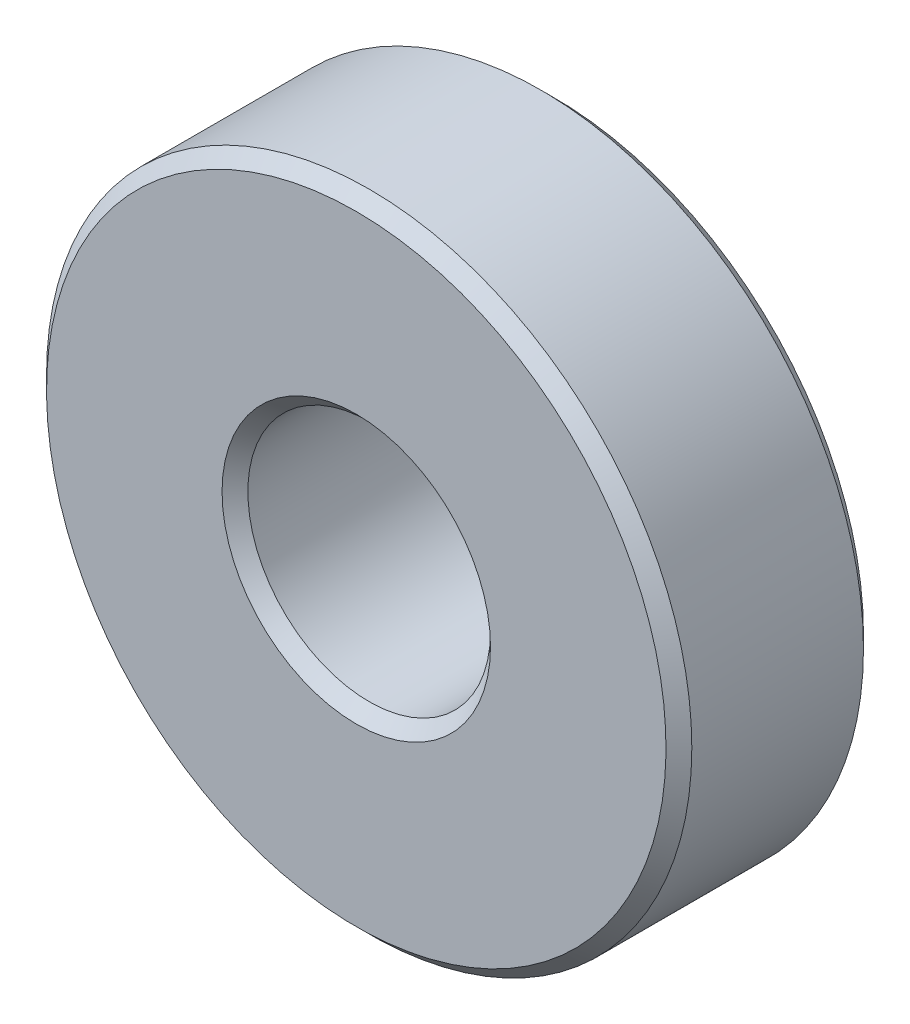
ISO-10303-21;
HEADER;
FILE_DESCRIPTION(('STEP AP214'),'2;1');
FILE_NAME('part.step','',(''),(''),'','','');
FILE_SCHEMA(('AUTOMOTIVE_DESIGN { 1 0 10303 214 1 1 1 1 }'));
ENDSEC;
DATA;
#1=APPLICATION_CONTEXT('core data for automotive mechanical design processes');
#2=APPLICATION_PROTOCOL_DEFINITION('international standard','automotive_design',2000,#1);
#3=PRODUCT_CONTEXT('',#1,'mechanical');
#4=PRODUCT('Part','Part','',(#3));
#5=PRODUCT_RELATED_PRODUCT_CATEGORY('part','',(#4));
#6=PRODUCT_DEFINITION_FORMATION('','',#4);
#7=PRODUCT_DEFINITION_CONTEXT('part definition',#1,'design');
#8=PRODUCT_DEFINITION('design','',#6,#7);
#9=PRODUCT_DEFINITION_SHAPE('','',#8);
#10=(LENGTH_UNIT() NAMED_UNIT(*) SI_UNIT(.MILLI.,.METRE.));
#11=(NAMED_UNIT(*) PLANE_ANGLE_UNIT() SI_UNIT($,.RADIAN.));
#12=(NAMED_UNIT(*) SI_UNIT($,.STERADIAN.) SOLID_ANGLE_UNIT());
#13=UNCERTAINTY_MEASURE_WITH_UNIT(LENGTH_MEASURE(1.E-05),#10,'distance_accuracy_value','');
#14=(GEOMETRIC_REPRESENTATION_CONTEXT(3) GLOBAL_UNCERTAINTY_ASSIGNED_CONTEXT((#13)) GLOBAL_UNIT_ASSIGNED_CONTEXT((#10,
#11,#12)) REPRESENTATION_CONTEXT('',''));
#15=CARTESIAN_POINT('',(0.,0.,0.));
#16=DIRECTION('',(0.,0.,1.));
#17=DIRECTION('',(1.,0.,0.));
#18=AXIS2_PLACEMENT_3D('',#15,#16,#17);
#19=CARTESIAN_POINT('',(0.,0.,0.));
#20=DIRECTION('',(0.,0.,-1.));
#21=DIRECTION('',(-1.,0.,0.));
#22=AXIS2_PLACEMENT_3D('',#19,#20,#21);
#23=PLANE('',#22);
#24=CARTESIAN_POINT('',(0.,0.,-5.6843418860808E-11));
#25=DIRECTION('',(0.,0.,-1.));
#26=DIRECTION('',(-1.,0.,0.));
#27=AXIS2_PLACEMENT_3D('',#24,#25,#26);
#28=CIRCLE('',#27,2.64159999994718);
#29=CARTESIAN_POINT('',(-2.64159999994718,0.,-5.6843418860808E-11));
#30=VERTEX_POINT('',#29);
#31=EDGE_CURVE('E31',#30,#30,#28,.F.);
#32=ORIENTED_EDGE('',*,*,#31,.T.);
#33=EDGE_LOOP('',(#32));
#34=FACE_BOUND('',#33,.T.);
#35=CARTESIAN_POINT('',(0.,0.,-5.6843418860808E-11));
#36=DIRECTION('',(0.,0.,1.));
#37=DIRECTION('',(1.,0.,0.));
#38=AXIS2_PLACEMENT_3D('',#35,#36,#37);
#39=CIRCLE('',#38,6.09599999989996);
#40=CARTESIAN_POINT('',(6.09599999989996,0.,-5.6843418860808E-11));
#41=VERTEX_POINT('',#40);
#42=EDGE_CURVE('E17',#41,#41,#39,.T.);
#43=ORIENTED_EDGE('',*,*,#42,.F.);
#44=EDGE_LOOP('',(#43));
#45=FACE_BOUND('',#44,.T.);
#46=ADVANCED_FACE('F14',(#34,#45),#23,.T.);
#47=CARTESIAN_POINT('',(0.,0.,0.253999999927146));
#48=DIRECTION('',(0.,0.,1.));
#49=DIRECTION('',(1.,0.,0.));
#50=AXIS2_PLACEMENT_3D('',#47,#48,#49);
#51=CONICAL_SURFACE('',#50,6.34999999988394,0.785398163397448);
#52=CARTESIAN_POINT('',(0.,0.,0.254));
#53=DIRECTION('',(0.,0.,1.));
#54=DIRECTION('',(1.,0.,0.));
#55=AXIS2_PLACEMENT_3D('',#52,#53,#54);
#56=CIRCLE('',#55,6.34999999999999);
#57=CARTESIAN_POINT('',(6.34999999999999,0.,0.254));
#58=VERTEX_POINT('',#57);
#59=EDGE_CURVE('E29',#58,#58,#56,.T.);
#60=ORIENTED_EDGE('',*,*,#59,.F.);
#61=EDGE_LOOP('',(#60));
#62=FACE_BOUND('',#61,.T.);
#63=ORIENTED_EDGE('',*,*,#42,.T.);
#64=EDGE_LOOP('',(#63));
#65=FACE_BOUND('',#64,.T.);
#66=ADVANCED_FACE('F40',(#62,#65),#51,.T.);
#67=CARTESIAN_POINT('',(0.,0.,-5.6843418860808E-11));
#68=DIRECTION('',(0.,0.,-1.));
#69=DIRECTION('',(-1.,0.,0.));
#70=AXIS2_PLACEMENT_3D('',#67,#68,#69);
#71=CONICAL_SURFACE('',#70,2.64159999994718,0.785398163285552);
#72=CARTESIAN_POINT('',(0.,0.,0.254000000040833));
#73=DIRECTION('',(0.,0.,1.));
#74=DIRECTION('',(1.,0.,0.));
#75=AXIS2_PLACEMENT_3D('',#72,#73,#74);
#76=CIRCLE('',#75,2.3876);
#77=CARTESIAN_POINT('',(2.3876,0.,0.254000000040833));
#78=VERTEX_POINT('',#77);
#79=EDGE_CURVE('E36',#78,#78,#76,.T.);
#80=ORIENTED_EDGE('',*,*,#79,.T.);
#81=EDGE_LOOP('',(#80));
#82=FACE_BOUND('',#81,.T.);
#83=ORIENTED_EDGE('',*,*,#31,.F.);
#84=EDGE_LOOP('',(#83));
#85=FACE_BOUND('',#84,.T.);
#86=ADVANCED_FACE('F47',(#82,#85),#71,.F.);
#87=CARTESIAN_POINT('',(0.,0.,3.8862));
#88=DIRECTION('',(0.,0.,1.));
#89=DIRECTION('',(1.,0.,0.));
#90=AXIS2_PLACEMENT_3D('',#87,#88,#89);
#91=CYLINDRICAL_SURFACE('',#90,6.34999999999999);
#92=CARTESIAN_POINT('',(0.,0.,3.63220000002684));
#93=DIRECTION('',(0.,0.,-1.));
#94=DIRECTION('',(-1.,0.,0.));
#95=AXIS2_PLACEMENT_3D('',#92,#93,#94);
#96=CIRCLE('',#95,6.3499999999408);
#97=CARTESIAN_POINT('',(-6.34999999994079,0.,3.63220000002684));
#98=VERTEX_POINT('',#97);
#99=EDGE_CURVE('E80',#98,#98,#96,.F.);
#100=ORIENTED_EDGE('',*,*,#99,.F.);
#101=EDGE_LOOP('',(#100));
#102=FACE_BOUND('',#101,.T.);
#103=ORIENTED_EDGE('',*,*,#59,.T.);
#104=EDGE_LOOP('',(#103));
#105=FACE_BOUND('',#104,.T.);
#106=ADVANCED_FACE('F68',(#102,#105),#91,.T.);
#107=CARTESIAN_POINT('',(0.,0.,3.8862));
#108=DIRECTION('',(0.,0.,1.));
#109=DIRECTION('',(1.,0.,0.));
#110=AXIS2_PLACEMENT_3D('',#107,#108,#109);
#111=CYLINDRICAL_SURFACE('',#110,2.3876);
#112=ORIENTED_EDGE('',*,*,#79,.F.);
#113=EDGE_LOOP('',(#112));
#114=FACE_BOUND('',#113,.T.);
#115=CARTESIAN_POINT('',(0.,0.,3.63219999997));
#116=DIRECTION('',(0.,0.,1.));
#117=DIRECTION('',(1.,0.,0.));
#118=AXIS2_PLACEMENT_3D('',#115,#116,#117);
#119=CIRCLE('',#118,2.38759999996318);
#120=CARTESIAN_POINT('',(2.38759999996319,0.,3.63219999997));
#121=VERTEX_POINT('',#120);
#122=EDGE_CURVE('E26',#121,#121,#119,.T.);
#123=ORIENTED_EDGE('',*,*,#122,.T.);
#124=EDGE_LOOP('',(#123));
#125=FACE_BOUND('',#124,.T.);
#126=ADVANCED_FACE('F64',(#114,#125),#111,.F.);
#127=CARTESIAN_POINT('',(0.,0.,3.63220000008369));
#128=DIRECTION('',(0.,0.,-1.));
#129=DIRECTION('',(0.,1.,0.));
#130=AXIS2_PLACEMENT_3D('',#127,#128,#129);
#131=CONICAL_SURFACE('',#130,6.34999999988395,0.785398163397448);
#132=ORIENTED_EDGE('',*,*,#99,.T.);
#133=EDGE_LOOP('',(#132));
#134=FACE_BOUND('',#133,.T.);
#135=CARTESIAN_POINT('',(0.,0.,3.88620000001083));
#136=DIRECTION('',(0.,0.,-1.));
#137=DIRECTION('',(0.,1.,0.));
#138=AXIS2_PLACEMENT_3D('',#135,#136,#137);
#139=CIRCLE('',#138,6.09599999995681);
#140=CARTESIAN_POINT('',(0.,6.09599999995681,3.88620000001083));
#141=VERTEX_POINT('',#140);
#142=EDGE_CURVE('E21',#141,#141,#139,.T.);
#143=ORIENTED_EDGE('',*,*,#142,.T.);
#144=EDGE_LOOP('',(#143));
#145=FACE_BOUND('',#144,.T.);
#146=ADVANCED_FACE('F57',(#134,#145),#131,.T.);
#147=CARTESIAN_POINT('',(0.,0.,3.88620000006767));
#148=DIRECTION('',(0.,0.,1.));
#149=DIRECTION('',(1.,0.,0.));
#150=AXIS2_PLACEMENT_3D('',#147,#148,#149);
#151=CONICAL_SURFACE('',#150,2.64160000000401,0.785398163285552);
#152=ORIENTED_EDGE('',*,*,#122,.F.);
#153=EDGE_LOOP('',(#152));
#154=FACE_BOUND('',#153,.T.);
#155=CARTESIAN_POINT('',(0.,0.,3.88620000006767));
#156=DIRECTION('',(0.,0.,1.));
#157=DIRECTION('',(1.,0.,0.));
#158=AXIS2_PLACEMENT_3D('',#155,#156,#157);
#159=CIRCLE('',#158,2.64160000000401);
#160=CARTESIAN_POINT('',(2.64160000000402,0.,3.88620000006767));
#161=VERTEX_POINT('',#160);
#162=EDGE_CURVE('E10',#161,#161,#159,.T.);
#163=ORIENTED_EDGE('',*,*,#162,.T.);
#164=EDGE_LOOP('',(#163));
#165=FACE_BOUND('',#164,.T.);
#166=ADVANCED_FACE('F51',(#154,#165),#151,.F.);
#167=CARTESIAN_POINT('',(0.,0.,3.8862));
#168=DIRECTION('',(0.,0.,-1.));
#169=DIRECTION('',(-1.,0.,0.));
#170=AXIS2_PLACEMENT_3D('',#167,#168,#169);
#171=PLANE('',#170);
#172=ORIENTED_EDGE('',*,*,#162,.F.);
#173=EDGE_LOOP('',(#172));
#174=FACE_BOUND('',#173,.T.);
#175=ORIENTED_EDGE('',*,*,#142,.F.);
#176=EDGE_LOOP('',(#175));
#177=FACE_BOUND('',#176,.T.);
#178=ADVANCED_FACE('F49',(#174,#177),#171,.F.);
#179=CLOSED_SHELL('',(#46,#66,#86,#106,#126,#146,#166,#178));
#180=MANIFOLD_SOLID_BREP('B1',#179);
#181=ADVANCED_BREP_SHAPE_REPRESENTATION('',(#18,#180),#14);
#182=SHAPE_DEFINITION_REPRESENTATION(#9,#181);
ENDSEC;
END-ISO-10303-21;
